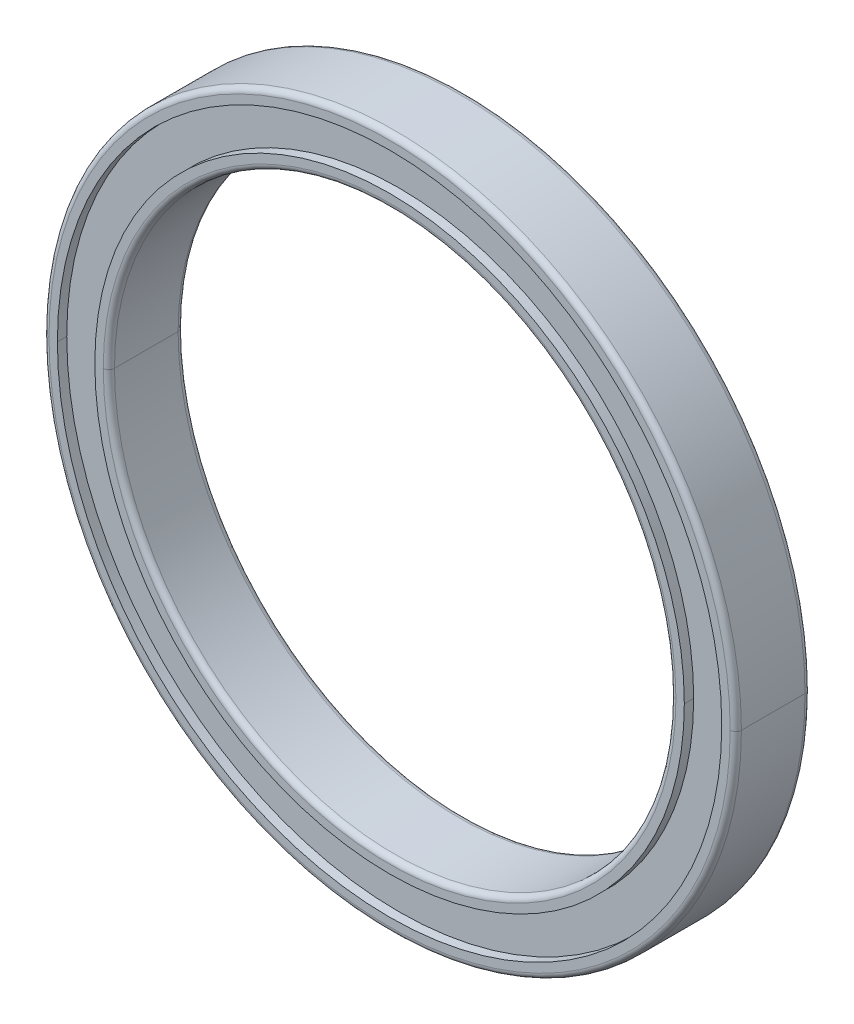
ISO-10303-21;
HEADER;
FILE_DESCRIPTION(('STEP AP214'),'2;1');
FILE_NAME('part.step','',(''),(''),'','','');
FILE_SCHEMA(('AUTOMOTIVE_DESIGN { 1 0 10303 214 1 1 1 1 }'));
ENDSEC;
DATA;
#1=APPLICATION_CONTEXT('core data for automotive mechanical design processes');
#2=APPLICATION_PROTOCOL_DEFINITION('international standard','automotive_design',2000,#1);
#3=PRODUCT_CONTEXT('',#1,'mechanical');
#4=PRODUCT('Part','Part','',(#3));
#5=PRODUCT_RELATED_PRODUCT_CATEGORY('part','',(#4));
#6=PRODUCT_DEFINITION_FORMATION('','',#4);
#7=PRODUCT_DEFINITION_CONTEXT('part definition',#1,'design');
#8=PRODUCT_DEFINITION('design','',#6,#7);
#9=PRODUCT_DEFINITION_SHAPE('','',#8);
#10=(LENGTH_UNIT() NAMED_UNIT(*) SI_UNIT(.MILLI.,.METRE.));
#11=(NAMED_UNIT(*) PLANE_ANGLE_UNIT() SI_UNIT($,.RADIAN.));
#12=(NAMED_UNIT(*) SI_UNIT($,.STERADIAN.) SOLID_ANGLE_UNIT());
#13=UNCERTAINTY_MEASURE_WITH_UNIT(LENGTH_MEASURE(1.E-05),#10,'distance_accuracy_value','');
#14=(GEOMETRIC_REPRESENTATION_CONTEXT(3) GLOBAL_UNCERTAINTY_ASSIGNED_CONTEXT((#13)) GLOBAL_UNIT_ASSIGNED_CONTEXT((#10,
#11,#12)) REPRESENTATION_CONTEXT('',''));
#15=CARTESIAN_POINT('',(0.,0.,0.));
#16=DIRECTION('',(0.,0.,1.));
#17=DIRECTION('',(1.,0.,0.));
#18=AXIS2_PLACEMENT_3D('',#15,#16,#17);
#19=CARTESIAN_POINT('',(0.,0.,0.5));
#20=DIRECTION('',(0.,0.,-1.));
#21=DIRECTION('',(-1.,0.,0.));
#22=AXIS2_PLACEMENT_3D('',#19,#20,#21);
#23=CYLINDRICAL_SURFACE('',#22,15.75);
#24=CARTESIAN_POINT('',(0.,0.,0.5));
#25=DIRECTION('',(0.,0.,-1.));
#26=DIRECTION('',(1.,0.,0.));
#27=AXIS2_PLACEMENT_3D('',#24,#25,#26);
#28=CIRCLE('',#27,15.75);
#29=CARTESIAN_POINT('',(15.75,0.,0.5));
#30=VERTEX_POINT('',#29);
#31=CARTESIAN_POINT('',(-15.75,0.,0.5));
#32=VERTEX_POINT('',#31);
#33=EDGE_CURVE('E220',#30,#32,#28,.T.);
#34=ORIENTED_EDGE('',*,*,#33,.T.);
#35=DIRECTION('',(0.,0.,1.));
#36=VECTOR('',#35,1.);
#37=CARTESIAN_POINT('',(-15.75,0.,0.));
#38=LINE('',#37,#36);
#39=CARTESIAN_POINT('',(-15.75,0.,0.));
#40=VERTEX_POINT('',#39);
#41=EDGE_CURVE('E244',#40,#32,#38,.T.);
#42=ORIENTED_EDGE('',*,*,#41,.F.);
#43=CARTESIAN_POINT('',(0.,0.,0.));
#44=DIRECTION('',(0.,0.,1.));
#45=DIRECTION('',(-1.,0.,0.));
#46=AXIS2_PLACEMENT_3D('',#43,#44,#45);
#47=CIRCLE('',#46,15.75);
#48=CARTESIAN_POINT('',(15.75,0.,0.));
#49=VERTEX_POINT('',#48);
#50=EDGE_CURVE('E276',#40,#49,#47,.T.);
#51=ORIENTED_EDGE('',*,*,#50,.T.);
#52=DIRECTION('',(0.,0.,1.));
#53=VECTOR('',#52,1.);
#54=CARTESIAN_POINT('',(15.75,0.,0.));
#55=LINE('',#54,#53);
#56=EDGE_CURVE('E284',#49,#30,#55,.T.);
#57=ORIENTED_EDGE('',*,*,#56,.T.);
#58=EDGE_LOOP('',(#34,#42,#51,#57));
#59=FACE_BOUND('',#58,.T.);
#60=ADVANCED_FACE('F17',(#59),#23,.T.);
#61=CARTESIAN_POINT('',(0.,0.,0.3));
#62=DIRECTION('',(0.,0.,1.));
#63=DIRECTION('',(1.,0.,0.));
#64=AXIS2_PLACEMENT_3D('',#61,#62,#63);
#65=TOROIDAL_SURFACE('',#64,18.2,0.3);
#66=CARTESIAN_POINT('',(-18.2,0.,0.3));
#67=DIRECTION('',(0.,-1.,0.));
#68=DIRECTION('',(-1.,0.,0.));
#69=AXIS2_PLACEMENT_3D('',#66,#67,#68);
#70=CIRCLE('',#69,0.3);
#71=CARTESIAN_POINT('',(-18.5,0.,0.3));
#72=VERTEX_POINT('',#71);
#73=CARTESIAN_POINT('',(-18.2,0.,0.));
#74=VERTEX_POINT('',#73);
#75=EDGE_CURVE('E11',#72,#74,#70,.T.);
#76=ORIENTED_EDGE('',*,*,#75,.F.);
#77=CARTESIAN_POINT('',(0.,0.,0.3));
#78=DIRECTION('',(0.,0.,1.));
#79=DIRECTION('',(1.,0.,0.));
#80=AXIS2_PLACEMENT_3D('',#77,#78,#79);
#81=CIRCLE('',#80,18.5);
#82=CARTESIAN_POINT('',(18.5,0.,0.3));
#83=VERTEX_POINT('',#82);
#84=EDGE_CURVE('E329',#83,#72,#81,.T.);
#85=ORIENTED_EDGE('',*,*,#84,.F.);
#86=CARTESIAN_POINT('',(18.2,0.,0.3));
#87=DIRECTION('',(0.,1.,0.));
#88=DIRECTION('',(1.,0.,0.));
#89=AXIS2_PLACEMENT_3D('',#86,#87,#88);
#90=CIRCLE('',#89,0.3);
#91=CARTESIAN_POINT('',(18.2,0.,0.));
#92=VERTEX_POINT('',#91);
#93=EDGE_CURVE('E28',#83,#92,#90,.T.);
#94=ORIENTED_EDGE('',*,*,#93,.T.);
#95=CARTESIAN_POINT('',(0.,0.,0.));
#96=DIRECTION('',(0.,0.,1.));
#97=DIRECTION('',(1.,0.,0.));
#98=AXIS2_PLACEMENT_3D('',#95,#96,#97);
#99=CIRCLE('',#98,18.2);
#100=EDGE_CURVE('E245',#92,#74,#99,.T.);
#101=ORIENTED_EDGE('',*,*,#100,.T.);
#102=EDGE_LOOP('',(#76,#85,#94,#101));
#103=FACE_BOUND('',#102,.T.);
#104=ADVANCED_FACE('F361',(#103),#65,.T.);
#105=CARTESIAN_POINT('',(0.,0.,0.3));
#106=DIRECTION('',(0.,0.,1.));
#107=DIRECTION('',(1.,0.,0.));
#108=AXIS2_PLACEMENT_3D('',#105,#106,#107);
#109=TOROIDAL_SURFACE('',#108,18.2,0.3);
#110=CARTESIAN_POINT('',(0.,0.,0.));
#111=DIRECTION('',(0.,0.,1.));
#112=DIRECTION('',(-1.,0.,0.));
#113=AXIS2_PLACEMENT_3D('',#110,#111,#112);
#114=CIRCLE('',#113,18.2);
#115=EDGE_CURVE('E249',#74,#92,#114,.T.);
#116=ORIENTED_EDGE('',*,*,#115,.T.);
#117=ORIENTED_EDGE('',*,*,#93,.F.);
#118=CARTESIAN_POINT('',(0.,0.,0.3));
#119=DIRECTION('',(0.,0.,1.));
#120=DIRECTION('',(-1.,0.,0.));
#121=AXIS2_PLACEMENT_3D('',#118,#119,#120);
#122=CIRCLE('',#121,18.5);
#123=EDGE_CURVE('E265',#72,#83,#122,.T.);
#124=ORIENTED_EDGE('',*,*,#123,.F.);
#125=ORIENTED_EDGE('',*,*,#75,.T.);
#126=EDGE_LOOP('',(#116,#117,#124,#125));
#127=FACE_BOUND('',#126,.T.);
#128=ADVANCED_FACE('F359',(#127),#109,.T.);
#129=CARTESIAN_POINT('',(0.,0.,0.));
#130=DIRECTION('',(0.,0.,1.));
#131=DIRECTION('',(1.,0.,0.));
#132=AXIS2_PLACEMENT_3D('',#129,#130,#131);
#133=PLANE('',#132);
#134=CARTESIAN_POINT('',(0.,0.,0.));
#135=DIRECTION('',(0.,0.,-1.));
#136=DIRECTION('',(1.,0.,0.));
#137=AXIS2_PLACEMENT_3D('',#134,#135,#136);
#138=CIRCLE('',#137,17.75);
#139=CARTESIAN_POINT('',(17.75,0.,0.));
#140=VERTEX_POINT('',#139);
#141=CARTESIAN_POINT('',(-17.75,0.,0.));
#142=VERTEX_POINT('',#141);
#143=EDGE_CURVE('E212',#140,#142,#138,.T.);
#144=ORIENTED_EDGE('',*,*,#143,.F.);
#145=CARTESIAN_POINT('',(0.,0.,0.));
#146=DIRECTION('',(0.,0.,-1.));
#147=DIRECTION('',(-1.,0.,0.));
#148=AXIS2_PLACEMENT_3D('',#145,#146,#147);
#149=CIRCLE('',#148,17.75);
#150=EDGE_CURVE('E320',#142,#140,#149,.T.);
#151=ORIENTED_EDGE('',*,*,#150,.F.);
#152=EDGE_LOOP('',(#144,#151));
#153=FACE_BOUND('',#152,.T.);
#154=ORIENTED_EDGE('',*,*,#100,.F.);
#155=ORIENTED_EDGE('',*,*,#115,.F.);
#156=EDGE_LOOP('',(#154,#155));
#157=FACE_BOUND('',#156,.T.);
#158=ADVANCED_FACE('F363',(#153,#157),#133,.F.);
#159=CARTESIAN_POINT('',(0.,0.,0.5));
#160=DIRECTION('',(0.,0.,-1.));
#161=DIRECTION('',(-1.,0.,0.));
#162=AXIS2_PLACEMENT_3D('',#159,#160,#161);
#163=CYLINDRICAL_SURFACE('',#162,17.75);
#164=DIRECTION('',(0.,0.,1.));
#165=VECTOR('',#164,1.);
#166=CARTESIAN_POINT('',(17.75,0.,0.));
#167=LINE('',#166,#165);
#168=CARTESIAN_POINT('',(17.75,0.,0.5));
#169=VERTEX_POINT('',#168);
#170=EDGE_CURVE('E77',#140,#169,#167,.T.);
#171=ORIENTED_EDGE('',*,*,#170,.F.);
#172=ORIENTED_EDGE('',*,*,#143,.T.);
#173=DIRECTION('',(0.,0.,1.));
#174=VECTOR('',#173,1.);
#175=CARTESIAN_POINT('',(-17.75,0.,0.));
#176=LINE('',#175,#174);
#177=CARTESIAN_POINT('',(-17.75,0.,0.5));
#178=VERTEX_POINT('',#177);
#179=EDGE_CURVE('E88',#142,#178,#176,.T.);
#180=ORIENTED_EDGE('',*,*,#179,.T.);
#181=CARTESIAN_POINT('',(0.,0.,0.5));
#182=DIRECTION('',(0.,0.,1.));
#183=DIRECTION('',(-1.,0.,0.));
#184=AXIS2_PLACEMENT_3D('',#181,#182,#183);
#185=CIRCLE('',#184,17.75);
#186=EDGE_CURVE('E214',#178,#169,#185,.T.);
#187=ORIENTED_EDGE('',*,*,#186,.T.);
#188=EDGE_LOOP('',(#171,#172,#180,#187));
#189=FACE_BOUND('',#188,.T.);
#190=ADVANCED_FACE('F365',(#189),#163,.F.);
#191=CARTESIAN_POINT('',(0.,0.,0.5));
#192=DIRECTION('',(0.,0.,-1.));
#193=DIRECTION('',(-1.,0.,0.));
#194=AXIS2_PLACEMENT_3D('',#191,#192,#193);
#195=CYLINDRICAL_SURFACE('',#194,17.75);
#196=CARTESIAN_POINT('',(0.,0.,0.5));
#197=DIRECTION('',(0.,0.,1.));
#198=DIRECTION('',(1.,0.,0.));
#199=AXIS2_PLACEMENT_3D('',#196,#197,#198);
#200=CIRCLE('',#199,17.75);
#201=EDGE_CURVE('E216',#169,#178,#200,.T.);
#202=ORIENTED_EDGE('',*,*,#201,.T.);
#203=ORIENTED_EDGE('',*,*,#179,.F.);
#204=ORIENTED_EDGE('',*,*,#150,.T.);
#205=ORIENTED_EDGE('',*,*,#170,.T.);
#206=EDGE_LOOP('',(#202,#203,#204,#205));
#207=FACE_BOUND('',#206,.T.);
#208=ADVANCED_FACE('F19',(#207),#195,.F.);
#209=CARTESIAN_POINT('',(0.,0.,0.5));
#210=DIRECTION('',(0.,0.,-1.));
#211=DIRECTION('',(0.,-1.,0.));
#212=AXIS2_PLACEMENT_3D('',#209,#210,#211);
#213=PLANE('',#212);
#214=ORIENTED_EDGE('',*,*,#33,.F.);
#215=CARTESIAN_POINT('',(0.,0.,0.5));
#216=DIRECTION('',(0.,0.,-1.));
#217=DIRECTION('',(-1.,0.,0.));
#218=AXIS2_PLACEMENT_3D('',#215,#216,#217);
#219=CIRCLE('',#218,15.75);
#220=EDGE_CURVE('E217',#32,#30,#219,.T.);
#221=ORIENTED_EDGE('',*,*,#220,.F.);
#222=EDGE_LOOP('',(#214,#221));
#223=FACE_BOUND('',#222,.T.);
#224=ORIENTED_EDGE('',*,*,#186,.F.);
#225=ORIENTED_EDGE('',*,*,#201,.F.);
#226=EDGE_LOOP('',(#224,#225));
#227=FACE_BOUND('',#226,.T.);
#228=ADVANCED_FACE('F463',(#223,#227),#213,.T.);
#229=CARTESIAN_POINT('',(0.,0.,0.5));
#230=DIRECTION('',(0.,0.,-1.));
#231=DIRECTION('',(-1.,0.,0.));
#232=AXIS2_PLACEMENT_3D('',#229,#230,#231);
#233=CYLINDRICAL_SURFACE('',#232,15.75);
#234=ORIENTED_EDGE('',*,*,#56,.F.);
#235=CARTESIAN_POINT('',(0.,0.,0.));
#236=DIRECTION('',(0.,0.,1.));
#237=DIRECTION('',(1.,0.,0.));
#238=AXIS2_PLACEMENT_3D('',#235,#236,#237);
#239=CIRCLE('',#238,15.75);
#240=EDGE_CURVE('E288',#49,#40,#239,.T.);
#241=ORIENTED_EDGE('',*,*,#240,.T.);
#242=ORIENTED_EDGE('',*,*,#41,.T.);
#243=ORIENTED_EDGE('',*,*,#220,.T.);
#244=EDGE_LOOP('',(#234,#241,#242,#243));
#245=FACE_BOUND('',#244,.T.);
#246=ADVANCED_FACE('F465',(#245),#233,.T.);
#247=CARTESIAN_POINT('',(0.,0.,0.));
#248=DIRECTION('',(0.,0.,1.));
#249=DIRECTION('',(1.,0.,0.));
#250=AXIS2_PLACEMENT_3D('',#247,#248,#249);
#251=PLANE('',#250);
#252=CARTESIAN_POINT('',(0.,0.,0.));
#253=DIRECTION('',(0.,0.,-1.));
#254=DIRECTION('',(1.,0.,0.));
#255=AXIS2_PLACEMENT_3D('',#252,#253,#254);
#256=CIRCLE('',#255,15.3);
#257=CARTESIAN_POINT('',(15.3,0.,0.));
#258=VERTEX_POINT('',#257);
#259=CARTESIAN_POINT('',(-15.3,0.,0.));
#260=VERTEX_POINT('',#259);
#261=EDGE_CURVE('E270',#258,#260,#256,.T.);
#262=ORIENTED_EDGE('',*,*,#261,.F.);
#263=CARTESIAN_POINT('',(0.,0.,0.));
#264=DIRECTION('',(0.,0.,-1.));
#265=DIRECTION('',(-1.,0.,0.));
#266=AXIS2_PLACEMENT_3D('',#263,#264,#265);
#267=CIRCLE('',#266,15.3);
#268=EDGE_CURVE('E273',#260,#258,#267,.T.);
#269=ORIENTED_EDGE('',*,*,#268,.F.);
#270=EDGE_LOOP('',(#262,#269));
#271=FACE_BOUND('',#270,.T.);
#272=ORIENTED_EDGE('',*,*,#50,.F.);
#273=ORIENTED_EDGE('',*,*,#240,.F.);
#274=EDGE_LOOP('',(#272,#273));
#275=FACE_BOUND('',#274,.T.);
#276=ADVANCED_FACE('F472',(#271,#275),#251,.F.);
#277=CARTESIAN_POINT('',(0.,0.,0.3));
#278=DIRECTION('',(0.,0.,1.));
#279=DIRECTION('',(1.,0.,0.));
#280=AXIS2_PLACEMENT_3D('',#277,#278,#279);
#281=TOROIDAL_SURFACE('',#280,15.3,0.3);
#282=CARTESIAN_POINT('',(-15.3,0.,0.3));
#283=DIRECTION('',(0.,-1.,0.));
#284=DIRECTION('',(0.,0.,-1.));
#285=AXIS2_PLACEMENT_3D('',#282,#283,#284);
#286=CIRCLE('',#285,0.3);
#287=CARTESIAN_POINT('',(-15.,0.,0.3));
#288=VERTEX_POINT('',#287);
#289=EDGE_CURVE('E277',#260,#288,#286,.T.);
#290=ORIENTED_EDGE('',*,*,#289,.F.);
#291=ORIENTED_EDGE('',*,*,#268,.T.);
#292=CARTESIAN_POINT('',(15.3,0.,0.3));
#293=DIRECTION('',(0.,1.,0.));
#294=DIRECTION('',(0.,0.,-1.));
#295=AXIS2_PLACEMENT_3D('',#292,#293,#294);
#296=CIRCLE('',#295,0.3);
#297=CARTESIAN_POINT('',(15.,0.,0.3));
#298=VERTEX_POINT('',#297);
#299=EDGE_CURVE('E267',#258,#298,#296,.T.);
#300=ORIENTED_EDGE('',*,*,#299,.T.);
#301=CARTESIAN_POINT('',(0.,0.,0.3));
#302=DIRECTION('',(0.,0.,-1.));
#303=DIRECTION('',(-1.,0.,0.));
#304=AXIS2_PLACEMENT_3D('',#301,#302,#303);
#305=CIRCLE('',#304,15.);
#306=EDGE_CURVE('E184',#288,#298,#305,.T.);
#307=ORIENTED_EDGE('',*,*,#306,.F.);
#308=EDGE_LOOP('',(#290,#291,#300,#307));
#309=FACE_BOUND('',#308,.T.);
#310=ADVANCED_FACE('F501',(#309),#281,.T.);
#311=CARTESIAN_POINT('',(0.,0.,0.3));
#312=DIRECTION('',(0.,0.,1.));
#313=DIRECTION('',(1.,0.,0.));
#314=AXIS2_PLACEMENT_3D('',#311,#312,#313);
#315=TOROIDAL_SURFACE('',#314,15.3,0.3);
#316=CARTESIAN_POINT('',(0.,0.,0.3));
#317=DIRECTION('',(0.,0.,-1.));
#318=DIRECTION('',(1.,0.,0.));
#319=AXIS2_PLACEMENT_3D('',#316,#317,#318);
#320=CIRCLE('',#319,15.);
#321=EDGE_CURVE('E181',#298,#288,#320,.T.);
#322=ORIENTED_EDGE('',*,*,#321,.F.);
#323=ORIENTED_EDGE('',*,*,#299,.F.);
#324=ORIENTED_EDGE('',*,*,#261,.T.);
#325=ORIENTED_EDGE('',*,*,#289,.T.);
#326=EDGE_LOOP('',(#322,#323,#324,#325));
#327=FACE_BOUND('',#326,.T.);
#328=ADVANCED_FACE('F387',(#327),#315,.T.);
#329=CARTESIAN_POINT('',(0.,0.,4.));
#330=DIRECTION('',(0.,0.,-1.));
#331=DIRECTION('',(-1.,0.,0.));
#332=AXIS2_PLACEMENT_3D('',#329,#330,#331);
#333=CYLINDRICAL_SURFACE('',#332,15.);
#334=DIRECTION('',(0.,0.,1.));
#335=VECTOR('',#334,1.);
#336=CARTESIAN_POINT('',(15.,0.,0.3));
#337=LINE('',#336,#335);
#338=CARTESIAN_POINT('',(15.,0.,3.7));
#339=VERTEX_POINT('',#338);
#340=EDGE_CURVE('E166',#298,#339,#337,.T.);
#341=ORIENTED_EDGE('',*,*,#340,.F.);
#342=ORIENTED_EDGE('',*,*,#321,.T.);
#343=DIRECTION('',(0.,0.,1.));
#344=VECTOR('',#343,1.);
#345=CARTESIAN_POINT('',(-15.,0.,0.3));
#346=LINE('',#345,#344);
#347=CARTESIAN_POINT('',(-15.,0.,3.7));
#348=VERTEX_POINT('',#347);
#349=EDGE_CURVE('E175',#288,#348,#346,.T.);
#350=ORIENTED_EDGE('',*,*,#349,.T.);
#351=CARTESIAN_POINT('',(0.,0.,3.7));
#352=DIRECTION('',(0.,0.,1.));
#353=DIRECTION('',(-1.,0.,0.));
#354=AXIS2_PLACEMENT_3D('',#351,#352,#353);
#355=CIRCLE('',#354,15.);
#356=EDGE_CURVE('E178',#348,#339,#355,.T.);
#357=ORIENTED_EDGE('',*,*,#356,.T.);
#358=EDGE_LOOP('',(#341,#342,#350,#357));
#359=FACE_BOUND('',#358,.T.);
#360=ADVANCED_FACE('F176',(#359),#333,.F.);
#361=CARTESIAN_POINT('',(0.,0.,4.));
#362=DIRECTION('',(0.,0.,-1.));
#363=DIRECTION('',(-1.,0.,0.));
#364=AXIS2_PLACEMENT_3D('',#361,#362,#363);
#365=CYLINDRICAL_SURFACE('',#364,15.);
#366=CARTESIAN_POINT('',(0.,0.,3.7));
#367=DIRECTION('',(0.,0.,1.));
#368=DIRECTION('',(1.,0.,0.));
#369=AXIS2_PLACEMENT_3D('',#366,#367,#368);
#370=CIRCLE('',#369,15.);
#371=EDGE_CURVE('E185',#339,#348,#370,.T.);
#372=ORIENTED_EDGE('',*,*,#371,.T.);
#373=ORIENTED_EDGE('',*,*,#349,.F.);
#374=ORIENTED_EDGE('',*,*,#306,.T.);
#375=ORIENTED_EDGE('',*,*,#340,.T.);
#376=EDGE_LOOP('',(#372,#373,#374,#375));
#377=FACE_BOUND('',#376,.T.);
#378=ADVANCED_FACE('F188',(#377),#365,.F.);
#379=CARTESIAN_POINT('',(0.,0.,3.7));
#380=DIRECTION('',(0.,0.,1.));
#381=DIRECTION('',(1.,0.,0.));
#382=AXIS2_PLACEMENT_3D('',#379,#380,#381);
#383=TOROIDAL_SURFACE('',#382,15.3,0.3);
#384=CARTESIAN_POINT('',(-15.3,0.,3.7));
#385=DIRECTION('',(0.,-1.,0.));
#386=DIRECTION('',(1.,0.,0.));
#387=AXIS2_PLACEMENT_3D('',#384,#385,#386);
#388=CIRCLE('',#387,0.3);
#389=CARTESIAN_POINT('',(-15.3,0.,4.));
#390=VERTEX_POINT('',#389);
#391=EDGE_CURVE('E21',#348,#390,#388,.T.);
#392=ORIENTED_EDGE('',*,*,#391,.F.);
#393=ORIENTED_EDGE('',*,*,#371,.F.);
#394=CARTESIAN_POINT('',(15.3,0.,3.7));
#395=DIRECTION('',(0.,1.,0.));
#396=DIRECTION('',(-1.,0.,0.));
#397=AXIS2_PLACEMENT_3D('',#394,#395,#396);
#398=CIRCLE('',#397,0.3);
#399=CARTESIAN_POINT('',(15.3,0.,4.));
#400=VERTEX_POINT('',#399);
#401=EDGE_CURVE('E201',#339,#400,#398,.T.);
#402=ORIENTED_EDGE('',*,*,#401,.T.);
#403=CARTESIAN_POINT('',(0.,0.,4.));
#404=DIRECTION('',(0.,0.,1.));
#405=DIRECTION('',(1.,0.,0.));
#406=AXIS2_PLACEMENT_3D('',#403,#404,#405);
#407=CIRCLE('',#406,15.3);
#408=EDGE_CURVE('E195',#400,#390,#407,.T.);
#409=ORIENTED_EDGE('',*,*,#408,.T.);
#410=EDGE_LOOP('',(#392,#393,#402,#409));
#411=FACE_BOUND('',#410,.T.);
#412=ADVANCED_FACE('F193',(#411),#383,.T.);
#413=CARTESIAN_POINT('',(0.,0.,3.7));
#414=DIRECTION('',(0.,0.,1.));
#415=DIRECTION('',(1.,0.,0.));
#416=AXIS2_PLACEMENT_3D('',#413,#414,#415);
#417=TOROIDAL_SURFACE('',#416,15.3,0.3);
#418=CARTESIAN_POINT('',(0.,0.,4.));
#419=DIRECTION('',(0.,0.,1.));
#420=DIRECTION('',(-1.,0.,0.));
#421=AXIS2_PLACEMENT_3D('',#418,#419,#420);
#422=CIRCLE('',#421,15.3);
#423=EDGE_CURVE('E208',#390,#400,#422,.T.);
#424=ORIENTED_EDGE('',*,*,#423,.T.);
#425=ORIENTED_EDGE('',*,*,#401,.F.);
#426=ORIENTED_EDGE('',*,*,#356,.F.);
#427=ORIENTED_EDGE('',*,*,#391,.T.);
#428=EDGE_LOOP('',(#424,#425,#426,#427));
#429=FACE_BOUND('',#428,.T.);
#430=ADVANCED_FACE('F200',(#429),#417,.T.);
#431=CARTESIAN_POINT('',(0.,0.,4.));
#432=DIRECTION('',(0.,0.,1.));
#433=DIRECTION('',(1.,0.,0.));
#434=AXIS2_PLACEMENT_3D('',#431,#432,#433);
#435=PLANE('',#434);
#436=ORIENTED_EDGE('',*,*,#408,.F.);
#437=ORIENTED_EDGE('',*,*,#423,.F.);
#438=EDGE_LOOP('',(#436,#437));
#439=FACE_BOUND('',#438,.T.);
#440=CARTESIAN_POINT('',(0.,0.,4.));
#441=DIRECTION('',(0.,0.,-1.));
#442=DIRECTION('',(1.,0.,0.));
#443=AXIS2_PLACEMENT_3D('',#440,#441,#442);
#444=CIRCLE('',#443,15.75);
#445=CARTESIAN_POINT('',(15.75,0.,4.));
#446=VERTEX_POINT('',#445);
#447=CARTESIAN_POINT('',(-15.75,0.,4.));
#448=VERTEX_POINT('',#447);
#449=EDGE_CURVE('E316',#446,#448,#444,.T.);
#450=ORIENTED_EDGE('',*,*,#449,.F.);
#451=CARTESIAN_POINT('',(0.,0.,4.));
#452=DIRECTION('',(0.,0.,-1.));
#453=DIRECTION('',(-1.,0.,0.));
#454=AXIS2_PLACEMENT_3D('',#451,#452,#453);
#455=CIRCLE('',#454,15.75);
#456=EDGE_CURVE('E255',#448,#446,#455,.T.);
#457=ORIENTED_EDGE('',*,*,#456,.F.);
#458=EDGE_LOOP('',(#450,#457));
#459=FACE_BOUND('',#458,.T.);
#460=ADVANCED_FACE('F588',(#439,#459),#435,.T.);
#461=CARTESIAN_POINT('',(0.,0.,3.5));
#462=DIRECTION('',(0.,0.,1.));
#463=DIRECTION('',(1.,0.,0.));
#464=AXIS2_PLACEMENT_3D('',#461,#462,#463);
#465=CYLINDRICAL_SURFACE('',#464,15.75);
#466=CARTESIAN_POINT('',(0.,0.,3.5));
#467=DIRECTION('',(0.,0.,1.));
#468=DIRECTION('',(-1.,0.,0.));
#469=AXIS2_PLACEMENT_3D('',#466,#467,#468);
#470=CIRCLE('',#469,15.75);
#471=CARTESIAN_POINT('',(-15.75,0.,3.5));
#472=VERTEX_POINT('',#471);
#473=CARTESIAN_POINT('',(15.75,0.,3.5));
#474=VERTEX_POINT('',#473);
#475=EDGE_CURVE('E235',#472,#474,#470,.T.);
#476=ORIENTED_EDGE('',*,*,#475,.T.);
#477=DIRECTION('',(0.,0.,-1.));
#478=VECTOR('',#477,1.);
#479=CARTESIAN_POINT('',(15.75,0.,4.));
#480=LINE('',#479,#478);
#481=EDGE_CURVE('E259',#446,#474,#480,.T.);
#482=ORIENTED_EDGE('',*,*,#481,.F.);
#483=ORIENTED_EDGE('',*,*,#449,.T.);
#484=DIRECTION('',(0.,0.,-1.));
#485=VECTOR('',#484,1.);
#486=CARTESIAN_POINT('',(-15.75,0.,4.));
#487=LINE('',#486,#485);
#488=EDGE_CURVE('E260',#448,#472,#487,.T.);
#489=ORIENTED_EDGE('',*,*,#488,.T.);
#490=EDGE_LOOP('',(#476,#482,#483,#489));
#491=FACE_BOUND('',#490,.T.);
#492=ADVANCED_FACE('F398',(#491),#465,.T.);
#493=CARTESIAN_POINT('',(0.,0.,3.5));
#494=DIRECTION('',(0.,0.,1.));
#495=DIRECTION('',(1.,0.,0.));
#496=AXIS2_PLACEMENT_3D('',#493,#494,#495);
#497=CYLINDRICAL_SURFACE('',#496,15.75);
#498=ORIENTED_EDGE('',*,*,#488,.F.);
#499=ORIENTED_EDGE('',*,*,#456,.T.);
#500=ORIENTED_EDGE('',*,*,#481,.T.);
#501=CARTESIAN_POINT('',(0.,0.,3.5));
#502=DIRECTION('',(0.,0.,1.));
#503=DIRECTION('',(1.,0.,0.));
#504=AXIS2_PLACEMENT_3D('',#501,#502,#503);
#505=CIRCLE('',#504,15.75);
#506=EDGE_CURVE('E238',#474,#472,#505,.T.);
#507=ORIENTED_EDGE('',*,*,#506,.T.);
#508=EDGE_LOOP('',(#498,#499,#500,#507));
#509=FACE_BOUND('',#508,.T.);
#510=ADVANCED_FACE('F391',(#509),#497,.T.);
#511=CARTESIAN_POINT('',(0.,0.,3.5));
#512=DIRECTION('',(0.,0.,1.));
#513=DIRECTION('',(1.,0.,0.));
#514=AXIS2_PLACEMENT_3D('',#511,#512,#513);
#515=PLANE('',#514);
#516=ORIENTED_EDGE('',*,*,#475,.F.);
#517=ORIENTED_EDGE('',*,*,#506,.F.);
#518=EDGE_LOOP('',(#516,#517));
#519=FACE_BOUND('',#518,.T.);
#520=CARTESIAN_POINT('',(0.,0.,3.5));
#521=DIRECTION('',(0.,0.,-1.));
#522=DIRECTION('',(1.,0.,0.));
#523=AXIS2_PLACEMENT_3D('',#520,#521,#522);
#524=CIRCLE('',#523,17.75);
#525=CARTESIAN_POINT('',(17.75,0.,3.5));
#526=VERTEX_POINT('',#525);
#527=CARTESIAN_POINT('',(-17.75,0.,3.5));
#528=VERTEX_POINT('',#527);
#529=EDGE_CURVE('E239',#526,#528,#524,.T.);
#530=ORIENTED_EDGE('',*,*,#529,.F.);
#531=CARTESIAN_POINT('',(0.,0.,3.5));
#532=DIRECTION('',(0.,0.,-1.));
#533=DIRECTION('',(-1.,0.,0.));
#534=AXIS2_PLACEMENT_3D('',#531,#532,#533);
#535=CIRCLE('',#534,17.75);
#536=EDGE_CURVE('E231',#528,#526,#535,.T.);
#537=ORIENTED_EDGE('',*,*,#536,.F.);
#538=EDGE_LOOP('',(#530,#537));
#539=FACE_BOUND('',#538,.T.);
#540=ADVANCED_FACE('F388',(#519,#539),#515,.T.);
#541=CARTESIAN_POINT('',(0.,0.,3.5));
#542=DIRECTION('',(0.,0.,1.));
#543=DIRECTION('',(1.,0.,0.));
#544=AXIS2_PLACEMENT_3D('',#541,#542,#543);
#545=CYLINDRICAL_SURFACE('',#544,17.75);
#546=DIRECTION('',(0.,0.,-1.));
#547=VECTOR('',#546,1.);
#548=CARTESIAN_POINT('',(-17.75,0.,4.));
#549=LINE('',#548,#547);
#550=CARTESIAN_POINT('',(-17.75,0.,4.));
#551=VERTEX_POINT('',#550);
#552=EDGE_CURVE('E291',#551,#528,#549,.T.);
#553=ORIENTED_EDGE('',*,*,#552,.F.);
#554=CARTESIAN_POINT('',(0.,0.,4.));
#555=DIRECTION('',(0.,0.,1.));
#556=DIRECTION('',(-1.,0.,0.));
#557=AXIS2_PLACEMENT_3D('',#554,#555,#556);
#558=CIRCLE('',#557,17.75);
#559=CARTESIAN_POINT('',(17.75,0.,4.));
#560=VERTEX_POINT('',#559);
#561=EDGE_CURVE('E232',#551,#560,#558,.T.);
#562=ORIENTED_EDGE('',*,*,#561,.T.);
#563=DIRECTION('',(0.,0.,-1.));
#564=VECTOR('',#563,1.);
#565=CARTESIAN_POINT('',(17.75,0.,4.));
#566=LINE('',#565,#564);
#567=EDGE_CURVE('E294',#560,#526,#566,.T.);
#568=ORIENTED_EDGE('',*,*,#567,.T.);
#569=ORIENTED_EDGE('',*,*,#529,.T.);
#570=EDGE_LOOP('',(#553,#562,#568,#569));
#571=FACE_BOUND('',#570,.T.);
#572=ADVANCED_FACE('F390',(#571),#545,.F.);
#573=CARTESIAN_POINT('',(0.,0.,3.5));
#574=DIRECTION('',(0.,0.,1.));
#575=DIRECTION('',(1.,0.,0.));
#576=AXIS2_PLACEMENT_3D('',#573,#574,#575);
#577=CYLINDRICAL_SURFACE('',#576,17.75);
#578=ORIENTED_EDGE('',*,*,#536,.T.);
#579=ORIENTED_EDGE('',*,*,#567,.F.);
#580=CARTESIAN_POINT('',(0.,0.,4.));
#581=DIRECTION('',(0.,0.,1.));
#582=DIRECTION('',(1.,0.,0.));
#583=AXIS2_PLACEMENT_3D('',#580,#581,#582);
#584=CIRCLE('',#583,17.75);
#585=EDGE_CURVE('E227',#560,#551,#584,.T.);
#586=ORIENTED_EDGE('',*,*,#585,.T.);
#587=ORIENTED_EDGE('',*,*,#552,.T.);
#588=EDGE_LOOP('',(#578,#579,#586,#587));
#589=FACE_BOUND('',#588,.T.);
#590=ADVANCED_FACE('F397',(#589),#577,.F.);
#591=CARTESIAN_POINT('',(0.,0.,4.));
#592=DIRECTION('',(0.,0.,1.));
#593=DIRECTION('',(1.,0.,0.));
#594=AXIS2_PLACEMENT_3D('',#591,#592,#593);
#595=PLANE('',#594);
#596=ORIENTED_EDGE('',*,*,#561,.F.);
#597=ORIENTED_EDGE('',*,*,#585,.F.);
#598=EDGE_LOOP('',(#596,#597));
#599=FACE_BOUND('',#598,.T.);
#600=CARTESIAN_POINT('',(0.,0.,4.));
#601=DIRECTION('',(0.,0.,-1.));
#602=DIRECTION('',(1.,0.,0.));
#603=AXIS2_PLACEMENT_3D('',#600,#601,#602);
#604=CIRCLE('',#603,18.2);
#605=CARTESIAN_POINT('',(18.2,0.,4.));
#606=VERTEX_POINT('',#605);
#607=CARTESIAN_POINT('',(-18.2,0.,4.));
#608=VERTEX_POINT('',#607);
#609=EDGE_CURVE('E324',#606,#608,#604,.T.);
#610=ORIENTED_EDGE('',*,*,#609,.F.);
#611=CARTESIAN_POINT('',(0.,0.,4.));
#612=DIRECTION('',(0.,0.,-1.));
#613=DIRECTION('',(-1.,0.,0.));
#614=AXIS2_PLACEMENT_3D('',#611,#612,#613);
#615=CIRCLE('',#614,18.2);
#616=EDGE_CURVE('E221',#608,#606,#615,.T.);
#617=ORIENTED_EDGE('',*,*,#616,.F.);
#618=EDGE_LOOP('',(#610,#617));
#619=FACE_BOUND('',#618,.T.);
#620=ADVANCED_FACE('F486',(#599,#619),#595,.T.);
#621=CARTESIAN_POINT('',(0.,0.,3.7));
#622=DIRECTION('',(0.,0.,1.));
#623=DIRECTION('',(1.,0.,0.));
#624=AXIS2_PLACEMENT_3D('',#621,#622,#623);
#625=TOROIDAL_SURFACE('',#624,18.2,0.3);
#626=CARTESIAN_POINT('',(0.,0.,3.7));
#627=DIRECTION('',(0.,0.,-1.));
#628=DIRECTION('',(1.,0.,0.));
#629=AXIS2_PLACEMENT_3D('',#626,#627,#628);
#630=CIRCLE('',#629,18.5);
#631=CARTESIAN_POINT('',(18.5,0.,3.7));
#632=VERTEX_POINT('',#631);
#633=CARTESIAN_POINT('',(-18.5,0.,3.7));
#634=VERTEX_POINT('',#633);
#635=EDGE_CURVE('E266',#632,#634,#630,.T.);
#636=ORIENTED_EDGE('',*,*,#635,.F.);
#637=CARTESIAN_POINT('',(18.2,0.,3.7));
#638=DIRECTION('',(0.,1.,0.));
#639=DIRECTION('',(0.,0.,1.));
#640=AXIS2_PLACEMENT_3D('',#637,#638,#639);
#641=CIRCLE('',#640,0.3);
#642=EDGE_CURVE('E225',#606,#632,#641,.T.);
#643=ORIENTED_EDGE('',*,*,#642,.F.);
#644=ORIENTED_EDGE('',*,*,#609,.T.);
#645=CARTESIAN_POINT('',(-18.2,0.,3.7));
#646=DIRECTION('',(0.,-1.,0.));
#647=DIRECTION('',(0.,0.,1.));
#648=AXIS2_PLACEMENT_3D('',#645,#646,#647);
#649=CIRCLE('',#648,0.3);
#650=EDGE_CURVE('E226',#608,#634,#649,.T.);
#651=ORIENTED_EDGE('',*,*,#650,.T.);
#652=EDGE_LOOP('',(#636,#643,#644,#651));
#653=FACE_BOUND('',#652,.T.);
#654=ADVANCED_FACE('F346',(#653),#625,.T.);
#655=CARTESIAN_POINT('',(0.,0.,3.7));
#656=DIRECTION('',(0.,0.,1.));
#657=DIRECTION('',(1.,0.,0.));
#658=AXIS2_PLACEMENT_3D('',#655,#656,#657);
#659=TOROIDAL_SURFACE('',#658,18.2,0.3);
#660=ORIENTED_EDGE('',*,*,#650,.F.);
#661=ORIENTED_EDGE('',*,*,#616,.T.);
#662=ORIENTED_EDGE('',*,*,#642,.T.);
#663=CARTESIAN_POINT('',(0.,0.,3.7));
#664=DIRECTION('',(0.,0.,-1.));
#665=DIRECTION('',(-1.,0.,0.));
#666=AXIS2_PLACEMENT_3D('',#663,#664,#665);
#667=CIRCLE('',#666,18.5);
#668=EDGE_CURVE('E254',#634,#632,#667,.T.);
#669=ORIENTED_EDGE('',*,*,#668,.F.);
#670=EDGE_LOOP('',(#660,#661,#662,#669));
#671=FACE_BOUND('',#670,.T.);
#672=ADVANCED_FACE('F351',(#671),#659,.T.);
#673=CARTESIAN_POINT('',(0.,0.,4.));
#674=DIRECTION('',(0.,0.,-1.));
#675=DIRECTION('',(-1.,0.,0.));
#676=AXIS2_PLACEMENT_3D('',#673,#674,#675);
#677=CYLINDRICAL_SURFACE('',#676,18.5);
#678=DIRECTION('',(0.,0.,1.));
#679=VECTOR('',#678,1.);
#680=CARTESIAN_POINT('',(18.5,0.,0.3));
#681=LINE('',#680,#679);
#682=EDGE_CURVE('E334',#83,#632,#681,.T.);
#683=ORIENTED_EDGE('',*,*,#682,.F.);
#684=ORIENTED_EDGE('',*,*,#84,.T.);
#685=DIRECTION('',(0.,0.,1.));
#686=VECTOR('',#685,1.);
#687=CARTESIAN_POINT('',(-18.5,0.,0.3));
#688=LINE('',#687,#686);
#689=EDGE_CURVE('E261',#72,#634,#688,.T.);
#690=ORIENTED_EDGE('',*,*,#689,.T.);
#691=ORIENTED_EDGE('',*,*,#668,.T.);
#692=EDGE_LOOP('',(#683,#684,#690,#691));
#693=FACE_BOUND('',#692,.T.);
#694=ADVANCED_FACE('F354',(#693),#677,.T.);
#695=CARTESIAN_POINT('',(0.,0.,4.));
#696=DIRECTION('',(0.,0.,-1.));
#697=DIRECTION('',(-1.,0.,0.));
#698=AXIS2_PLACEMENT_3D('',#695,#696,#697);
#699=CYLINDRICAL_SURFACE('',#698,18.5);
#700=ORIENTED_EDGE('',*,*,#635,.T.);
#701=ORIENTED_EDGE('',*,*,#689,.F.);
#702=ORIENTED_EDGE('',*,*,#123,.T.);
#703=ORIENTED_EDGE('',*,*,#682,.T.);
#704=EDGE_LOOP('',(#700,#701,#702,#703));
#705=FACE_BOUND('',#704,.T.);
#706=ADVANCED_FACE('F342',(#705),#699,.T.);
#707=CLOSED_SHELL('',(#60,#104,#128,#158,#190,#208,#228,#246,#276,#310,#328,#360,#378,#412,#430,
#460,#492,#510,#540,#572,#590,#620,#654,#672,#694,#706));
#708=MANIFOLD_SOLID_BREP('B1',#707);
#709=ADVANCED_BREP_SHAPE_REPRESENTATION('',(#18,#708),#14);
#710=SHAPE_DEFINITION_REPRESENTATION(#9,#709);
ENDSEC;
END-ISO-10303-21;
